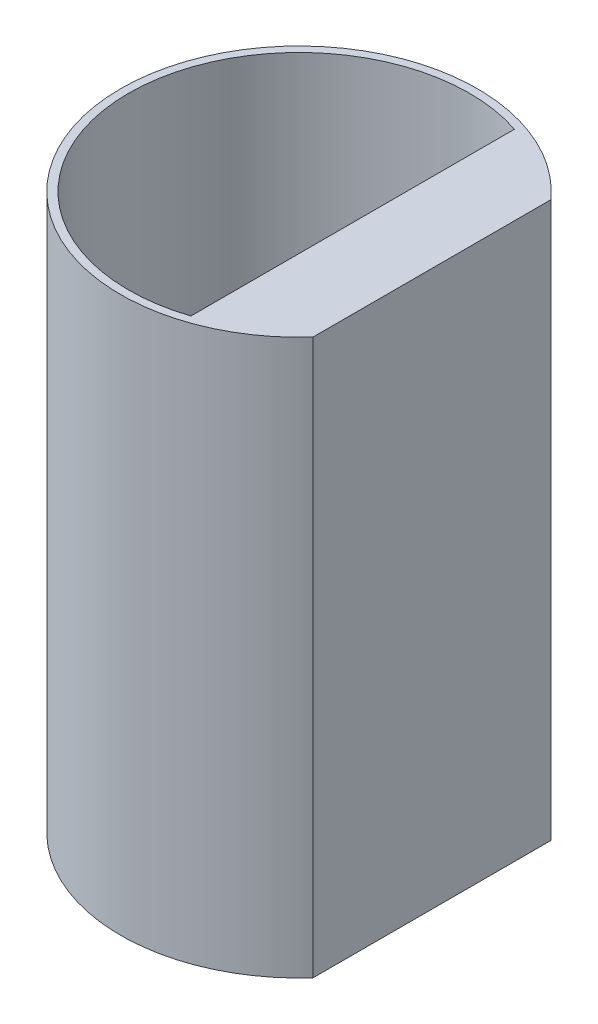
ISO-10303-21;
HEADER;
FILE_DESCRIPTION(('STEP AP214'),'2;1');
FILE_NAME('part.step','',(''),(''),'','','');
FILE_SCHEMA(('AUTOMOTIVE_DESIGN { 1 0 10303 214 1 1 1 1 }'));
ENDSEC;
DATA;
#1=APPLICATION_CONTEXT('core data for automotive mechanical design processes');
#2=APPLICATION_PROTOCOL_DEFINITION('international standard','automotive_design',2000,#1);
#3=PRODUCT_CONTEXT('',#1,'mechanical');
#4=PRODUCT('Part','Part','',(#3));
#5=PRODUCT_RELATED_PRODUCT_CATEGORY('part','',(#4));
#6=PRODUCT_DEFINITION_FORMATION('','',#4);
#7=PRODUCT_DEFINITION_CONTEXT('part definition',#1,'design');
#8=PRODUCT_DEFINITION('design','',#6,#7);
#9=PRODUCT_DEFINITION_SHAPE('','',#8);
#10=(LENGTH_UNIT() NAMED_UNIT(*) SI_UNIT(.MILLI.,.METRE.));
#11=(NAMED_UNIT(*) PLANE_ANGLE_UNIT() SI_UNIT($,.RADIAN.));
#12=(NAMED_UNIT(*) SI_UNIT($,.STERADIAN.) SOLID_ANGLE_UNIT());
#13=UNCERTAINTY_MEASURE_WITH_UNIT(LENGTH_MEASURE(1.E-05),#10,'distance_accuracy_value','');
#14=(GEOMETRIC_REPRESENTATION_CONTEXT(3) GLOBAL_UNCERTAINTY_ASSIGNED_CONTEXT((#13)) GLOBAL_UNIT_ASSIGNED_CONTEXT((#10,
#11,#12)) REPRESENTATION_CONTEXT('',''));
#15=CARTESIAN_POINT('',(0.,0.,0.));
#16=DIRECTION('',(0.,0.,1.));
#17=DIRECTION('',(1.,0.,0.));
#18=AXIS2_PLACEMENT_3D('',#15,#16,#17);
#19=CARTESIAN_POINT('',(0.,177.8,0.));
#20=DIRECTION('',(0.,1.,0.));
#21=DIRECTION('',(0.,0.,1.));
#22=AXIS2_PLACEMENT_3D('',#19,#20,#21);
#23=PLANE('',#22);
#24=DIRECTION('',(0.,0.,1.));
#25=VECTOR('',#24,1.);
#26=CARTESIAN_POINT('',(42.597094971371,177.8,0.));
#27=LINE('',#26,#25);
#28=CARTESIAN_POINT('',(42.597094971371,177.8,-38.1));
#29=VERTEX_POINT('',#28);
#30=CARTESIAN_POINT('',(42.597094971371,177.8,38.1));
#31=VERTEX_POINT('',#30);
#32=EDGE_CURVE('E90',#29,#31,#27,.T.);
#33=ORIENTED_EDGE('',*,*,#32,.F.);
#34=CARTESIAN_POINT('',(0.,177.8,0.));
#35=DIRECTION('',(0.,1.,0.));
#36=DIRECTION('',(0.,0.,1.));
#37=AXIS2_PLACEMENT_3D('',#34,#35,#36);
#38=CIRCLE('',#37,57.15);
#39=EDGE_CURVE('E11',#29,#31,#38,.T.);
#40=ORIENTED_EDGE('',*,*,#39,.T.);
#41=EDGE_LOOP('',(#33,#40));
#42=FACE_BOUND('',#41,.T.);
#43=CARTESIAN_POINT('',(0.,177.8,0.));
#44=DIRECTION('',(0.,1.,0.));
#45=DIRECTION('',(0.,0.,1.));
#46=AXIS2_PLACEMENT_3D('',#43,#44,#45);
#47=CIRCLE('',#46,54.61);
#48=CARTESIAN_POINT('',(17.197094971371,177.8,-51.8315736259825));
#49=VERTEX_POINT('',#48);
#50=CARTESIAN_POINT('',(17.197094971371,177.8,51.8315736259825));
#51=VERTEX_POINT('',#50);
#52=EDGE_CURVE('E81',#49,#51,#47,.T.);
#53=ORIENTED_EDGE('',*,*,#52,.F.);
#54=DIRECTION('',(0.,0.,1.));
#55=VECTOR('',#54,1.);
#56=CARTESIAN_POINT('',(17.197094971371,177.8,0.));
#57=LINE('',#56,#55);
#58=EDGE_CURVE('E48',#49,#51,#57,.T.);
#59=ORIENTED_EDGE('',*,*,#58,.T.);
#60=EDGE_LOOP('',(#53,#59));
#61=FACE_BOUND('',#60,.T.);
#62=ADVANCED_FACE('F33',(#42,#61),#23,.T.);
#63=CARTESIAN_POINT('',(0.,177.8,0.));
#64=DIRECTION('',(0.,-1.,0.));
#65=DIRECTION('',(0.,0.,-1.));
#66=AXIS2_PLACEMENT_3D('',#63,#64,#65);
#67=CYLINDRICAL_SURFACE('',#66,57.15);
#68=ORIENTED_EDGE('',*,*,#39,.F.);
#69=DIRECTION('',(0.,1.,0.));
#70=VECTOR('',#69,1.);
#71=CARTESIAN_POINT('',(42.597094971371,0.,-38.1));
#72=LINE('',#71,#70);
#73=CARTESIAN_POINT('',(42.597094971371,0.,-38.1));
#74=VERTEX_POINT('',#73);
#75=EDGE_CURVE('E97',#74,#29,#72,.T.);
#76=ORIENTED_EDGE('',*,*,#75,.F.);
#77=CARTESIAN_POINT('',(0.,0.,0.));
#78=DIRECTION('',(0.,1.,0.));
#79=DIRECTION('',(0.,0.,1.));
#80=AXIS2_PLACEMENT_3D('',#77,#78,#79);
#81=CIRCLE('',#80,57.15);
#82=CARTESIAN_POINT('',(42.597094971371,0.,38.1));
#83=VERTEX_POINT('',#82);
#84=EDGE_CURVE('E37',#74,#83,#81,.T.);
#85=ORIENTED_EDGE('',*,*,#84,.T.);
#86=DIRECTION('',(0.,1.,0.));
#87=VECTOR('',#86,1.);
#88=CARTESIAN_POINT('',(42.597094971371,0.,38.1));
#89=LINE('',#88,#87);
#90=EDGE_CURVE('E56',#83,#31,#89,.T.);
#91=ORIENTED_EDGE('',*,*,#90,.T.);
#92=EDGE_LOOP('',(#68,#76,#85,#91));
#93=FACE_BOUND('',#92,.T.);
#94=ADVANCED_FACE('F35',(#93),#67,.T.);
#95=CARTESIAN_POINT('',(0.,0.,0.));
#96=DIRECTION('',(0.,1.,0.));
#97=DIRECTION('',(0.,0.,1.));
#98=AXIS2_PLACEMENT_3D('',#95,#96,#97);
#99=PLANE('',#98);
#100=ORIENTED_EDGE('',*,*,#84,.F.);
#101=DIRECTION('',(0.,0.,1.));
#102=VECTOR('',#101,1.);
#103=CARTESIAN_POINT('',(42.597094971371,0.,0.));
#104=LINE('',#103,#102);
#105=EDGE_CURVE('E95',#74,#83,#104,.T.);
#106=ORIENTED_EDGE('',*,*,#105,.T.);
#107=EDGE_LOOP('',(#100,#106));
#108=FACE_BOUND('',#107,.T.);
#109=ADVANCED_FACE('F110',(#108),#99,.F.);
#110=CARTESIAN_POINT('',(42.597094971371,0.,0.));
#111=DIRECTION('',(-1.,0.,0.));
#112=DIRECTION('',(0.,0.,1.));
#113=AXIS2_PLACEMENT_3D('',#110,#111,#112);
#114=PLANE('',#113);
#115=ORIENTED_EDGE('',*,*,#32,.T.);
#116=ORIENTED_EDGE('',*,*,#90,.F.);
#117=ORIENTED_EDGE('',*,*,#105,.F.);
#118=ORIENTED_EDGE('',*,*,#75,.T.);
#119=EDGE_LOOP('',(#115,#116,#117,#118));
#120=FACE_BOUND('',#119,.T.);
#121=ADVANCED_FACE('F102',(#120),#114,.F.);
#122=CARTESIAN_POINT('',(0.,177.8,0.));
#123=DIRECTION('',(0.,-1.,0.));
#124=DIRECTION('',(0.,0.,-1.));
#125=AXIS2_PLACEMENT_3D('',#122,#123,#124);
#126=CYLINDRICAL_SURFACE('',#125,54.61);
#127=ORIENTED_EDGE('',*,*,#52,.T.);
#128=DIRECTION('',(0.,-1.,0.));
#129=VECTOR('',#128,1.);
#130=CARTESIAN_POINT('',(17.197094971371,12.7,51.8315736259825));
#131=LINE('',#130,#129);
#132=CARTESIAN_POINT('',(17.197094971371,12.7,51.8315736259825));
#133=VERTEX_POINT('',#132);
#134=EDGE_CURVE('E75',#133,#51,#131,.F.);
#135=ORIENTED_EDGE('',*,*,#134,.F.);
#136=CARTESIAN_POINT('',(0.,12.7,0.));
#137=DIRECTION('',(0.,1.,0.));
#138=DIRECTION('',(0.,0.,1.));
#139=AXIS2_PLACEMENT_3D('',#136,#137,#138);
#140=CIRCLE('',#139,54.61);
#141=CARTESIAN_POINT('',(17.197094971371,12.7,-51.8315736259825));
#142=VERTEX_POINT('',#141);
#143=EDGE_CURVE('E79',#142,#133,#140,.T.);
#144=ORIENTED_EDGE('',*,*,#143,.F.);
#145=DIRECTION('',(0.,-1.,0.));
#146=VECTOR('',#145,1.);
#147=CARTESIAN_POINT('',(17.197094971371,12.7,-51.8315736259825));
#148=LINE('',#147,#146);
#149=EDGE_CURVE('E82',#142,#49,#148,.F.);
#150=ORIENTED_EDGE('',*,*,#149,.T.);
#151=EDGE_LOOP('',(#127,#135,#144,#150));
#152=FACE_BOUND('',#151,.T.);
#153=ADVANCED_FACE('F77',(#152),#126,.F.);
#154=CARTESIAN_POINT('',(0.,12.7,0.));
#155=DIRECTION('',(0.,1.,0.));
#156=DIRECTION('',(0.,0.,1.));
#157=AXIS2_PLACEMENT_3D('',#154,#155,#156);
#158=PLANE('',#157);
#159=ORIENTED_EDGE('',*,*,#143,.T.);
#160=DIRECTION('',(0.,0.,1.));
#161=VECTOR('',#160,1.);
#162=CARTESIAN_POINT('',(17.197094971371,12.7,0.));
#163=LINE('',#162,#161);
#164=EDGE_CURVE('E84',#142,#133,#163,.T.);
#165=ORIENTED_EDGE('',*,*,#164,.F.);
#166=EDGE_LOOP('',(#159,#165));
#167=FACE_BOUND('',#166,.T.);
#168=ADVANCED_FACE('F88',(#167),#158,.T.);
#169=CARTESIAN_POINT('',(17.197094971371,0.,0.));
#170=DIRECTION('',(-1.,0.,0.));
#171=DIRECTION('',(0.,0.,1.));
#172=AXIS2_PLACEMENT_3D('',#169,#170,#171);
#173=PLANE('',#172);
#174=ORIENTED_EDGE('',*,*,#58,.F.);
#175=ORIENTED_EDGE('',*,*,#149,.F.);
#176=ORIENTED_EDGE('',*,*,#164,.T.);
#177=ORIENTED_EDGE('',*,*,#134,.T.);
#178=EDGE_LOOP('',(#174,#175,#176,#177));
#179=FACE_BOUND('',#178,.T.);
#180=ADVANCED_FACE('F85',(#179),#173,.T.);
#181=CLOSED_SHELL('',(#62,#94,#109,#121,#153,#168,#180));
#182=MANIFOLD_SOLID_BREP('B2',#181);
#183=ADVANCED_BREP_SHAPE_REPRESENTATION('',(#18,#182),#14);
#184=SHAPE_DEFINITION_REPRESENTATION(#9,#183);
ENDSEC;
END-ISO-10303-21;
